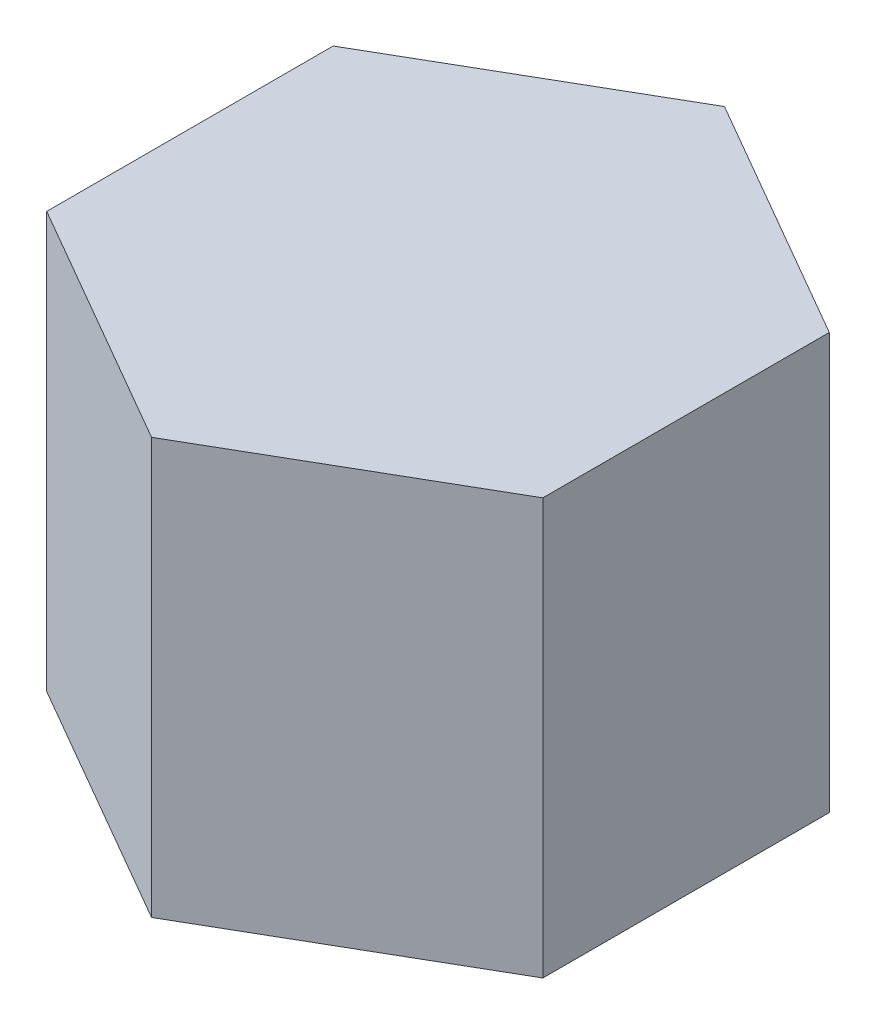
ISO-10303-21;
HEADER;
FILE_DESCRIPTION(('STEP AP214'),'2;1');
FILE_NAME('part.step','',(''),(''),'','','');
FILE_SCHEMA(('AUTOMOTIVE_DESIGN { 1 0 10303 214 1 1 1 1 }'));
ENDSEC;
DATA;
#1=APPLICATION_CONTEXT('core data for automotive mechanical design processes');
#2=APPLICATION_PROTOCOL_DEFINITION('international standard','automotive_design',2000,#1);
#3=PRODUCT_CONTEXT('',#1,'mechanical');
#4=PRODUCT('Part','Part','',(#3));
#5=PRODUCT_RELATED_PRODUCT_CATEGORY('part','',(#4));
#6=PRODUCT_DEFINITION_FORMATION('','',#4);
#7=PRODUCT_DEFINITION_CONTEXT('part definition',#1,'design');
#8=PRODUCT_DEFINITION('design','',#6,#7);
#9=PRODUCT_DEFINITION_SHAPE('','',#8);
#10=(LENGTH_UNIT() NAMED_UNIT(*) SI_UNIT(.MILLI.,.METRE.));
#11=(NAMED_UNIT(*) PLANE_ANGLE_UNIT() SI_UNIT($,.RADIAN.));
#12=(NAMED_UNIT(*) SI_UNIT($,.STERADIAN.) SOLID_ANGLE_UNIT());
#13=UNCERTAINTY_MEASURE_WITH_UNIT(LENGTH_MEASURE(1.E-05),#10,'distance_accuracy_value','');
#14=(GEOMETRIC_REPRESENTATION_CONTEXT(3) GLOBAL_UNCERTAINTY_ASSIGNED_CONTEXT((#13)) GLOBAL_UNIT_ASSIGNED_CONTEXT((#10,
#11,#12)) REPRESENTATION_CONTEXT('',''));
#15=CARTESIAN_POINT('',(0.,0.,0.));
#16=DIRECTION('',(0.,0.,1.));
#17=DIRECTION('',(1.,0.,0.));
#18=AXIS2_PLACEMENT_3D('',#15,#16,#17);
#19=CARTESIAN_POINT('',(204.142660308706,-148.537700895744,287.176844201572));
#20=DIRECTION('',(-0.499999999999943,0.,-0.866025403784472));
#21=DIRECTION('',(-0.866025403784472,0.,0.499999999999943));
#22=AXIS2_PLACEMENT_3D('',#19,#20,#21);
#23=PLANE('',#22);
#24=CARTESIAN_POINT('',(203.839551417382,-149.045793579175,287.351844201572));
#25=DIRECTION('',(0.866025403784471,0.,-0.499999999999943));
#26=VECTOR('',#25,1.);
#27=LINE('',#24,#26);
#28=CARTESIAN_POINT('',(203.839551417382,-149.045793579175,287.351844201572));
#29=VERTEX_POINT('',#28);
#30=CARTESIAN_POINT('',(204.142660308706,-149.045793579175,287.176844201572));
#31=VERTEX_POINT('',#30);
#32=EDGE_CURVE('E170',#29,#31,#27,.T.);
#33=ORIENTED_EDGE('',*,*,#32,.T.);
#34=CARTESIAN_POINT('',(204.142660308706,-148.537700895744,287.176844201572));
#35=DIRECTION('',(0.,-1.,0.));
#36=VECTOR('',#35,1.);
#37=LINE('',#34,#36);
#38=CARTESIAN_POINT('',(204.142660308706,-148.537700895744,287.176844201572));
#39=VERTEX_POINT('',#38);
#40=EDGE_CURVE('E35',#39,#31,#37,.T.);
#41=ORIENTED_EDGE('',*,*,#40,.F.);
#42=CARTESIAN_POINT('',(203.839551417382,-148.537700895744,287.351844201572));
#43=DIRECTION('',(0.866025403784471,0.,-0.499999999999943));
#44=VECTOR('',#43,1.);
#45=LINE('',#42,#44);
#46=CARTESIAN_POINT('',(203.839551417382,-148.537700895744,287.351844201572));
#47=VERTEX_POINT('',#46);
#48=EDGE_CURVE('E159',#47,#39,#45,.T.);
#49=ORIENTED_EDGE('',*,*,#48,.F.);
#50=CARTESIAN_POINT('',(203.839551417382,-148.537700895744,287.351844201572));
#51=DIRECTION('',(0.,-1.,0.));
#52=VECTOR('',#51,1.);
#53=LINE('',#50,#52);
#54=EDGE_CURVE('E10',#47,#29,#53,.T.);
#55=ORIENTED_EDGE('',*,*,#54,.T.);
#56=EDGE_LOOP('',(#33,#41,#49,#55));
#57=FACE_BOUND('',#56,.T.);
#58=ADVANCED_FACE('F16',(#57),#23,.F.);
#59=CARTESIAN_POINT('',(203.839551417382,-148.537700895744,287.351844201572));
#60=DIRECTION('',(0.499999999999978,0.,-0.866025403784452));
#61=DIRECTION('',(-0.866025403784452,0.,-0.499999999999978));
#62=AXIS2_PLACEMENT_3D('',#59,#60,#61);
#63=PLANE('',#62);
#64=CARTESIAN_POINT('',(203.536442526057,-149.045793579175,287.176844201572));
#65=DIRECTION('',(0.866025403784452,0.,0.499999999999978));
#66=VECTOR('',#65,1.);
#67=LINE('',#64,#66);
#68=CARTESIAN_POINT('',(203.536442526057,-149.045793579175,287.176844201572));
#69=VERTEX_POINT('',#68);
#70=EDGE_CURVE('E167',#69,#29,#67,.T.);
#71=ORIENTED_EDGE('',*,*,#70,.T.);
#72=ORIENTED_EDGE('',*,*,#54,.F.);
#73=CARTESIAN_POINT('',(203.536442526057,-148.537700895744,287.176844201572));
#74=DIRECTION('',(0.866025403784452,0.,0.499999999999978));
#75=VECTOR('',#74,1.);
#76=LINE('',#73,#75);
#77=CARTESIAN_POINT('',(203.536442526057,-148.537700895744,287.176844201572));
#78=VERTEX_POINT('',#77);
#79=EDGE_CURVE('E156',#78,#47,#76,.T.);
#80=ORIENTED_EDGE('',*,*,#79,.F.);
#81=CARTESIAN_POINT('',(203.536442526057,-148.537700895744,287.176844201572));
#82=DIRECTION('',(0.,-1.,0.));
#83=VECTOR('',#82,1.);
#84=LINE('',#81,#83);
#85=EDGE_CURVE('E27',#78,#69,#84,.T.);
#86=ORIENTED_EDGE('',*,*,#85,.T.);
#87=EDGE_LOOP('',(#71,#72,#80,#86));
#88=FACE_BOUND('',#87,.T.);
#89=ADVANCED_FACE('F189',(#88),#63,.F.);
#90=CARTESIAN_POINT('',(203.536442526057,-148.537700895744,290.831971220494));
#91=DIRECTION('',(1.,0.,0.));
#92=DIRECTION('',(0.,1.,0.));
#93=AXIS2_PLACEMENT_3D('',#90,#91,#92);
#94=PLANE('',#93);
#95=CARTESIAN_POINT('',(203.536442526057,-149.045793579175,286.826844201572));
#96=DIRECTION('',(0.,0.,1.));
#97=VECTOR('',#96,1.);
#98=LINE('',#95,#97);
#99=CARTESIAN_POINT('',(203.536442526057,-149.045793579175,286.826844201572));
#100=VERTEX_POINT('',#99);
#101=EDGE_CURVE('E163',#100,#69,#98,.T.);
#102=ORIENTED_EDGE('',*,*,#101,.T.);
#103=ORIENTED_EDGE('',*,*,#85,.F.);
#104=CARTESIAN_POINT('',(203.536442526057,-148.537700895744,286.826844201572));
#105=DIRECTION('',(0.,0.,1.));
#106=VECTOR('',#105,1.);
#107=LINE('',#104,#106);
#108=CARTESIAN_POINT('',(203.536442526057,-148.537700895744,286.826844201572));
#109=VERTEX_POINT('',#108);
#110=EDGE_CURVE('E106',#109,#78,#107,.T.);
#111=ORIENTED_EDGE('',*,*,#110,.F.);
#112=CARTESIAN_POINT('',(203.536442526057,-148.537700895744,286.826844201572));
#113=DIRECTION('',(0.,-1.,0.));
#114=VECTOR('',#113,1.);
#115=LINE('',#112,#114);
#116=EDGE_CURVE('E94',#109,#100,#115,.T.);
#117=ORIENTED_EDGE('',*,*,#116,.T.);
#118=EDGE_LOOP('',(#102,#103,#111,#117));
#119=FACE_BOUND('',#118,.T.);
#120=ADVANCED_FACE('F198',(#119),#94,.F.);
#121=CARTESIAN_POINT('',(203.536442526057,-148.537700895744,286.826844201572));
#122=DIRECTION('',(0.499999999999978,0.,0.866025403784452));
#123=DIRECTION('',(0.866025403784452,0.,-0.499999999999978));
#124=AXIS2_PLACEMENT_3D('',#121,#122,#123);
#125=PLANE('',#124);
#126=CARTESIAN_POINT('',(203.839551417382,-149.045793579175,286.651844201572));
#127=DIRECTION('',(-0.866025403784452,0.,0.499999999999978));
#128=VECTOR('',#127,1.);
#129=LINE('',#126,#128);
#130=CARTESIAN_POINT('',(203.839551417382,-149.045793579175,286.651844201572));
#131=VERTEX_POINT('',#130);
#132=EDGE_CURVE('E162',#131,#100,#129,.T.);
#133=ORIENTED_EDGE('',*,*,#132,.T.);
#134=ORIENTED_EDGE('',*,*,#116,.F.);
#135=CARTESIAN_POINT('',(203.839551417382,-148.537700895744,286.651844201572));
#136=DIRECTION('',(-0.866025403784452,0.,0.499999999999978));
#137=VECTOR('',#136,1.);
#138=LINE('',#135,#137);
#139=CARTESIAN_POINT('',(203.839551417382,-148.537700895744,286.651844201572));
#140=VERTEX_POINT('',#139);
#141=EDGE_CURVE('E98',#140,#109,#138,.T.);
#142=ORIENTED_EDGE('',*,*,#141,.F.);
#143=CARTESIAN_POINT('',(203.839551417382,-148.537700895744,286.651844201572));
#144=DIRECTION('',(0.,-1.,0.));
#145=VECTOR('',#144,1.);
#146=LINE('',#143,#145);
#147=EDGE_CURVE('E79',#140,#131,#146,.T.);
#148=ORIENTED_EDGE('',*,*,#147,.T.);
#149=EDGE_LOOP('',(#133,#134,#142,#148));
#150=FACE_BOUND('',#149,.T.);
#151=ADVANCED_FACE('F100',(#150),#125,.F.);
#152=CARTESIAN_POINT('',(203.839551417382,-148.537700895744,286.651844201572));
#153=DIRECTION('',(-0.499999999999978,0.,0.866025403784452));
#154=DIRECTION('',(0.866025403784452,0.,0.499999999999978));
#155=AXIS2_PLACEMENT_3D('',#152,#153,#154);
#156=PLANE('',#155);
#157=CARTESIAN_POINT('',(204.142660308706,-149.045793579175,286.826844201572));
#158=DIRECTION('',(-0.866025403784452,0.,-0.499999999999978));
#159=VECTOR('',#158,1.);
#160=LINE('',#157,#159);
#161=CARTESIAN_POINT('',(204.142660308706,-149.045793579175,286.826844201572));
#162=VERTEX_POINT('',#161);
#163=EDGE_CURVE('E88',#162,#131,#160,.T.);
#164=ORIENTED_EDGE('',*,*,#163,.T.);
#165=ORIENTED_EDGE('',*,*,#147,.F.);
#166=CARTESIAN_POINT('',(204.142660308706,-148.537700895744,286.826844201572));
#167=DIRECTION('',(-0.866025403784452,0.,-0.499999999999978));
#168=VECTOR('',#167,1.);
#169=LINE('',#166,#168);
#170=CARTESIAN_POINT('',(204.142660308706,-148.537700895744,286.826844201572));
#171=VERTEX_POINT('',#170);
#172=EDGE_CURVE('E84',#171,#140,#169,.T.);
#173=ORIENTED_EDGE('',*,*,#172,.F.);
#174=CARTESIAN_POINT('',(204.142660308706,-148.537700895744,286.826844201572));
#175=DIRECTION('',(0.,-1.,0.));
#176=VECTOR('',#175,1.);
#177=LINE('',#174,#176);
#178=EDGE_CURVE('E58',#171,#162,#177,.T.);
#179=ORIENTED_EDGE('',*,*,#178,.T.);
#180=EDGE_LOOP('',(#164,#165,#173,#179));
#181=FACE_BOUND('',#180,.T.);
#182=ADVANCED_FACE('F82',(#181),#156,.F.);
#183=CARTESIAN_POINT('',(204.142660308706,-148.537700895744,290.831971220494));
#184=DIRECTION('',(-1.,0.,0.));
#185=DIRECTION('',(0.,-1.,0.));
#186=AXIS2_PLACEMENT_3D('',#183,#184,#185);
#187=PLANE('',#186);
#188=CARTESIAN_POINT('',(204.142660308706,-149.045793579175,287.176844201572));
#189=DIRECTION('',(0.,0.,-1.));
#190=VECTOR('',#189,1.);
#191=LINE('',#188,#190);
#192=EDGE_CURVE('E160',#31,#162,#191,.T.);
#193=ORIENTED_EDGE('',*,*,#192,.T.);
#194=ORIENTED_EDGE('',*,*,#178,.F.);
#195=CARTESIAN_POINT('',(204.142660308706,-148.537700895744,287.176844201572));
#196=DIRECTION('',(0.,0.,-1.));
#197=VECTOR('',#196,1.);
#198=LINE('',#195,#197);
#199=EDGE_CURVE('E112',#39,#171,#198,.T.);
#200=ORIENTED_EDGE('',*,*,#199,.F.);
#201=ORIENTED_EDGE('',*,*,#40,.T.);
#202=EDGE_LOOP('',(#193,#194,#200,#201));
#203=FACE_BOUND('',#202,.T.);
#204=ADVANCED_FACE('F131',(#203),#187,.F.);
#205=CARTESIAN_POINT('',(206.339551417382,-148.537700895744,290.831971220494));
#206=DIRECTION('',(0.,-1.,0.));
#207=DIRECTION('',(1.,0.,0.));
#208=AXIS2_PLACEMENT_3D('',#205,#206,#207);
#209=PLANE('',#208);
#210=ORIENTED_EDGE('',*,*,#48,.T.);
#211=ORIENTED_EDGE('',*,*,#199,.T.);
#212=ORIENTED_EDGE('',*,*,#172,.T.);
#213=ORIENTED_EDGE('',*,*,#141,.T.);
#214=ORIENTED_EDGE('',*,*,#110,.T.);
#215=ORIENTED_EDGE('',*,*,#79,.T.);
#216=EDGE_LOOP('',(#210,#211,#212,#213,#214,#215));
#217=FACE_BOUND('',#216,.T.);
#218=ADVANCED_FACE('F111',(#217),#209,.F.);
#219=CARTESIAN_POINT('',(206.339551417382,-149.045793579175,290.831971220494));
#220=DIRECTION('',(0.,-1.,0.));
#221=DIRECTION('',(1.,0.,0.));
#222=AXIS2_PLACEMENT_3D('',#219,#220,#221);
#223=PLANE('',#222);
#224=ORIENTED_EDGE('',*,*,#32,.F.);
#225=ORIENTED_EDGE('',*,*,#70,.F.);
#226=ORIENTED_EDGE('',*,*,#101,.F.);
#227=ORIENTED_EDGE('',*,*,#132,.F.);
#228=ORIENTED_EDGE('',*,*,#163,.F.);
#229=ORIENTED_EDGE('',*,*,#192,.F.);
#230=EDGE_LOOP('',(#224,#225,#226,#227,#228,#229));
#231=FACE_BOUND('',#230,.T.);
#232=ADVANCED_FACE('F130',(#231),#223,.T.);
#233=CLOSED_SHELL('',(#58,#89,#120,#151,#182,#204,#218,#232));
#234=MANIFOLD_SOLID_BREP('B1',#233);
#235=ADVANCED_BREP_SHAPE_REPRESENTATION('',(#18,#234),#14);
#236=SHAPE_DEFINITION_REPRESENTATION(#9,#235);
ENDSEC;
END-ISO-10303-21;
